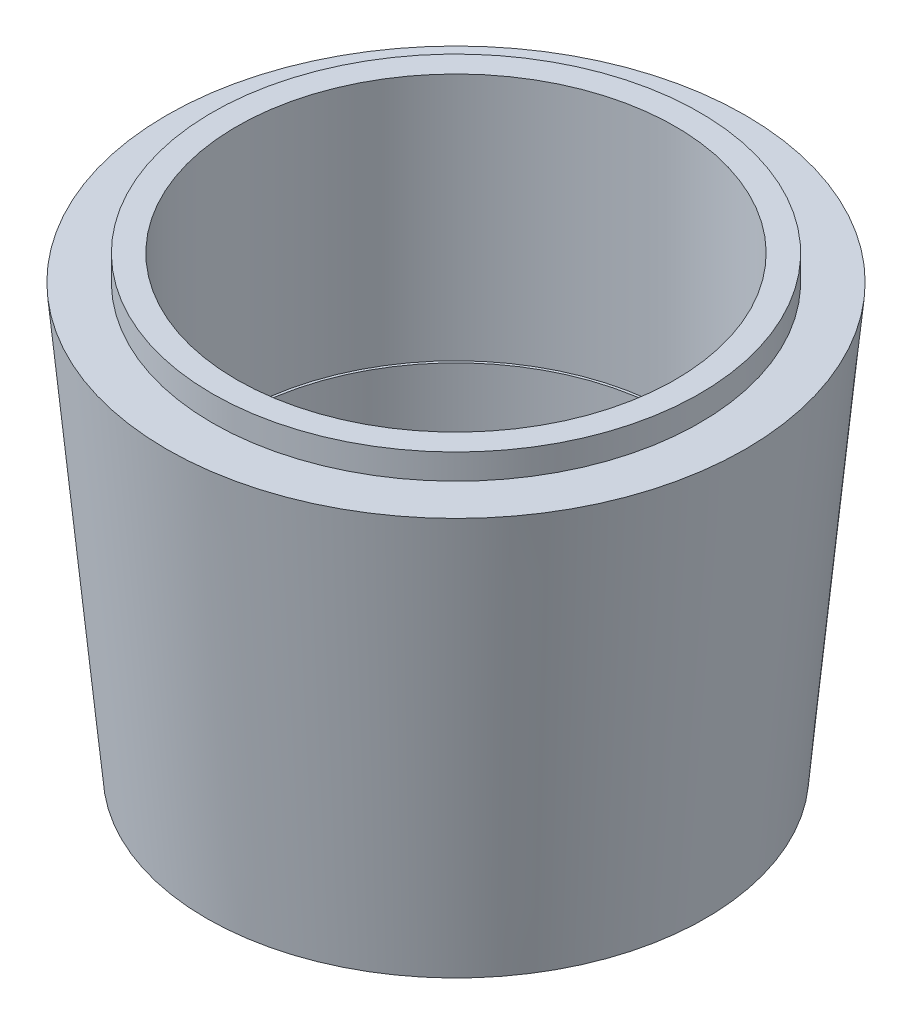
ISO-10303-21;
HEADER;
FILE_DESCRIPTION(('STEP AP214'),'2;1');
FILE_NAME('part.step','',(''),(''),'','','');
FILE_SCHEMA(('AUTOMOTIVE_DESIGN { 1 0 10303 214 1 1 1 1 }'));
ENDSEC;
DATA;
#1=APPLICATION_CONTEXT('core data for automotive mechanical design processes');
#2=APPLICATION_PROTOCOL_DEFINITION('international standard','automotive_design',2000,#1);
#3=PRODUCT_CONTEXT('',#1,'mechanical');
#4=PRODUCT('Part','Part','',(#3));
#5=PRODUCT_RELATED_PRODUCT_CATEGORY('part','',(#4));
#6=PRODUCT_DEFINITION_FORMATION('','',#4);
#7=PRODUCT_DEFINITION_CONTEXT('part definition',#1,'design');
#8=PRODUCT_DEFINITION('design','',#6,#7);
#9=PRODUCT_DEFINITION_SHAPE('','',#8);
#10=(LENGTH_UNIT() NAMED_UNIT(*) SI_UNIT(.MILLI.,.METRE.));
#11=(NAMED_UNIT(*) PLANE_ANGLE_UNIT() SI_UNIT($,.RADIAN.));
#12=(NAMED_UNIT(*) SI_UNIT($,.STERADIAN.) SOLID_ANGLE_UNIT());
#13=UNCERTAINTY_MEASURE_WITH_UNIT(LENGTH_MEASURE(1.E-05),#10,'distance_accuracy_value','');
#14=(GEOMETRIC_REPRESENTATION_CONTEXT(3) GLOBAL_UNCERTAINTY_ASSIGNED_CONTEXT((#13)) GLOBAL_UNIT_ASSIGNED_CONTEXT((#10,
#11,#12)) REPRESENTATION_CONTEXT('',''));
#15=CARTESIAN_POINT('',(0.,0.,0.));
#16=DIRECTION('',(0.,0.,1.));
#17=DIRECTION('',(1.,0.,0.));
#18=AXIS2_PLACEMENT_3D('',#15,#16,#17);
#19=CARTESIAN_POINT('',(20.066,-32.512,0.));
#20=DIRECTION('',(0.,-1.,0.));
#21=DIRECTION('',(0.,0.,-1.));
#22=AXIS2_PLACEMENT_3D('',#19,#20,#21);
#23=PLANE('',#22);
#24=CARTESIAN_POINT('',(0.,-32.512,0.));
#25=DIRECTION('',(0.,1.,0.));
#26=DIRECTION('',(0.,0.,1.));
#27=AXIS2_PLACEMENT_3D('',#24,#25,#26);
#28=CIRCLE('',#27,20.066);
#29=CARTESIAN_POINT('',(0.,-32.512,20.066));
#30=VERTEX_POINT('',#29);
#31=EDGE_CURVE('E10',#30,#30,#28,.T.);
#32=ORIENTED_EDGE('',*,*,#31,.F.);
#33=EDGE_LOOP('',(#32));
#34=FACE_BOUND('',#33,.T.);
#35=CARTESIAN_POINT('',(0.,-32.512,0.));
#36=DIRECTION('',(0.,1.,0.));
#37=DIRECTION('',(0.,0.,1.));
#38=AXIS2_PLACEMENT_3D('',#35,#36,#37);
#39=CIRCLE('',#38,21.7932);
#40=CARTESIAN_POINT('',(0.,-32.512,21.7932));
#41=VERTEX_POINT('',#40);
#42=EDGE_CURVE('E69',#41,#41,#39,.T.);
#43=ORIENTED_EDGE('',*,*,#42,.T.);
#44=EDGE_LOOP('',(#43));
#45=FACE_BOUND('',#44,.T.);
#46=ADVANCED_FACE('F35',(#34,#45),#23,.F.);
#47=CARTESIAN_POINT('',(0.,-32.512,0.));
#48=DIRECTION('',(0.,-1.,0.));
#49=DIRECTION('',(0.,0.,-1.));
#50=AXIS2_PLACEMENT_3D('',#47,#48,#49);
#51=CONICAL_SURFACE('',#50,20.066,0.235619449019235);
#52=CARTESIAN_POINT('',(0.,-42.8360146489052,0.));
#53=DIRECTION('',(0.,1.,0.));
#54=DIRECTION('',(0.,0.,1.));
#55=AXIS2_PLACEMENT_3D('',#52,#53,#54);
#56=CIRCLE('',#55,22.5445766256341);
#57=CARTESIAN_POINT('',(0.,-42.8360146489052,22.5445766256341));
#58=VERTEX_POINT('',#57);
#59=EDGE_CURVE('E41',#58,#58,#56,.T.);
#60=ORIENTED_EDGE('',*,*,#59,.F.);
#61=EDGE_LOOP('',(#60));
#62=FACE_BOUND('',#61,.T.);
#63=ORIENTED_EDGE('',*,*,#31,.T.);
#64=EDGE_LOOP('',(#63));
#65=FACE_BOUND('',#64,.T.);
#66=ADVANCED_FACE('F118',(#62,#65),#51,.F.);
#67=CARTESIAN_POINT('',(25.0845766256341,-42.8360146489052,0.));
#68=DIRECTION('',(0.,1.,0.));
#69=DIRECTION('',(0.,0.,1.));
#70=AXIS2_PLACEMENT_3D('',#67,#68,#69);
#71=PLANE('',#70);
#72=CARTESIAN_POINT('',(0.,-42.8360146489052,0.));
#73=DIRECTION('',(0.,1.,0.));
#74=DIRECTION('',(0.,0.,1.));
#75=AXIS2_PLACEMENT_3D('',#72,#73,#74);
#76=CIRCLE('',#75,25.0845766256341);
#77=CARTESIAN_POINT('',(0.,-42.8360146489052,25.0845766256341));
#78=VERTEX_POINT('',#77);
#79=EDGE_CURVE('E45',#78,#78,#76,.T.);
#80=ORIENTED_EDGE('',*,*,#79,.F.);
#81=EDGE_LOOP('',(#80));
#82=FACE_BOUND('',#81,.T.);
#83=ORIENTED_EDGE('',*,*,#59,.T.);
#84=EDGE_LOOP('',(#83));
#85=FACE_BOUND('',#84,.T.);
#86=ADVANCED_FACE('F113',(#82,#85),#71,.F.);
#87=CARTESIAN_POINT('',(0.,-42.8360146489052,0.));
#88=DIRECTION('',(0.,1.,0.));
#89=DIRECTION('',(0.,0.,1.));
#90=AXIS2_PLACEMENT_3D('',#87,#88,#89);
#91=CONICAL_SURFACE('',#90,25.0845766256341,0.0930728781754716);
#92=CARTESIAN_POINT('',(0.,0.,0.));
#93=DIRECTION('',(0.,1.,0.));
#94=DIRECTION('',(0.,0.,1.));
#95=AXIS2_PLACEMENT_3D('',#92,#93,#94);
#96=CIRCLE('',#95,29.083);
#97=CARTESIAN_POINT('',(0.,0.,29.083));
#98=VERTEX_POINT('',#97);
#99=EDGE_CURVE('E49',#98,#98,#96,.T.);
#100=ORIENTED_EDGE('',*,*,#99,.F.);
#101=EDGE_LOOP('',(#100));
#102=FACE_BOUND('',#101,.T.);
#103=ORIENTED_EDGE('',*,*,#79,.T.);
#104=EDGE_LOOP('',(#103));
#105=FACE_BOUND('',#104,.T.);
#106=ADVANCED_FACE('F107',(#102,#105),#91,.T.);
#107=CARTESIAN_POINT('',(24.4983,0.,0.));
#108=DIRECTION('',(0.,-1.,0.));
#109=DIRECTION('',(0.,0.,-1.));
#110=AXIS2_PLACEMENT_3D('',#107,#108,#109);
#111=PLANE('',#110);
#112=CARTESIAN_POINT('',(0.,0.,0.));
#113=DIRECTION('',(0.,1.,0.));
#114=DIRECTION('',(0.,0.,1.));
#115=AXIS2_PLACEMENT_3D('',#112,#113,#114);
#116=CIRCLE('',#115,24.4983);
#117=CARTESIAN_POINT('',(0.,0.,24.4983));
#118=VERTEX_POINT('',#117);
#119=EDGE_CURVE('E54',#118,#118,#116,.T.);
#120=ORIENTED_EDGE('',*,*,#119,.F.);
#121=EDGE_LOOP('',(#120));
#122=FACE_BOUND('',#121,.T.);
#123=ORIENTED_EDGE('',*,*,#99,.T.);
#124=EDGE_LOOP('',(#123));
#125=FACE_BOUND('',#124,.T.);
#126=ADVANCED_FACE('F101',(#122,#125),#111,.F.);
#127=CARTESIAN_POINT('',(0.,5.64153233054377,0.));
#128=DIRECTION('',(0.,1.,0.));
#129=DIRECTION('',(0.,0.,1.));
#130=AXIS2_PLACEMENT_3D('',#127,#128,#129);
#131=CYLINDRICAL_SURFACE('',#130,24.4983);
#132=CARTESIAN_POINT('',(0.,2.54,0.));
#133=DIRECTION('',(0.,1.,0.));
#134=DIRECTION('',(0.,0.,1.));
#135=AXIS2_PLACEMENT_3D('',#132,#133,#134);
#136=CIRCLE('',#135,24.4983);
#137=CARTESIAN_POINT('',(0.,2.54,24.4983));
#138=VERTEX_POINT('',#137);
#139=EDGE_CURVE('E57',#138,#138,#136,.T.);
#140=ORIENTED_EDGE('',*,*,#139,.F.);
#141=EDGE_LOOP('',(#140));
#142=FACE_BOUND('',#141,.T.);
#143=ORIENTED_EDGE('',*,*,#119,.T.);
#144=EDGE_LOOP('',(#143));
#145=FACE_BOUND('',#144,.T.);
#146=ADVANCED_FACE('F95',(#142,#145),#131,.T.);
#147=CARTESIAN_POINT('',(22.0472,2.54,0.));
#148=DIRECTION('',(0.,-1.,0.));
#149=DIRECTION('',(0.,0.,-1.));
#150=AXIS2_PLACEMENT_3D('',#147,#148,#149);
#151=PLANE('',#150);
#152=CARTESIAN_POINT('',(0.,2.54,0.));
#153=DIRECTION('',(0.,1.,0.));
#154=DIRECTION('',(0.,0.,1.));
#155=AXIS2_PLACEMENT_3D('',#152,#153,#154);
#156=CIRCLE('',#155,22.0472);
#157=CARTESIAN_POINT('',(0.,2.54,22.0472));
#158=VERTEX_POINT('',#157);
#159=EDGE_CURVE('E60',#158,#158,#156,.T.);
#160=ORIENTED_EDGE('',*,*,#159,.F.);
#161=EDGE_LOOP('',(#160));
#162=FACE_BOUND('',#161,.T.);
#163=ORIENTED_EDGE('',*,*,#139,.T.);
#164=EDGE_LOOP('',(#163));
#165=FACE_BOUND('',#164,.T.);
#166=ADVANCED_FACE('F89',(#162,#165),#151,.F.);
#167=CARTESIAN_POINT('',(0.,5.64153233054377,0.));
#168=DIRECTION('',(0.,1.,0.));
#169=DIRECTION('',(0.,0.,1.));
#170=AXIS2_PLACEMENT_3D('',#167,#168,#169);
#171=CYLINDRICAL_SURFACE('',#170,22.0472);
#172=CARTESIAN_POINT('',(0.,-22.4282,0.));
#173=DIRECTION('',(0.,1.,0.));
#174=DIRECTION('',(0.,0.,1.));
#175=AXIS2_PLACEMENT_3D('',#172,#173,#174);
#176=CIRCLE('',#175,22.0472);
#177=CARTESIAN_POINT('',(0.,-22.4282,22.0472));
#178=VERTEX_POINT('',#177);
#179=EDGE_CURVE('E63',#178,#178,#176,.T.);
#180=ORIENTED_EDGE('',*,*,#179,.F.);
#181=EDGE_LOOP('',(#180));
#182=FACE_BOUND('',#181,.T.);
#183=ORIENTED_EDGE('',*,*,#159,.T.);
#184=EDGE_LOOP('',(#183));
#185=FACE_BOUND('',#184,.T.);
#186=ADVANCED_FACE('F83',(#182,#185),#171,.F.);
#187=CARTESIAN_POINT('',(21.7932,-22.4282,0.));
#188=DIRECTION('',(0.,-1.,0.));
#189=DIRECTION('',(0.,0.,-1.));
#190=AXIS2_PLACEMENT_3D('',#187,#188,#189);
#191=PLANE('',#190);
#192=CARTESIAN_POINT('',(0.,-22.4282,0.));
#193=DIRECTION('',(0.,1.,0.));
#194=DIRECTION('',(0.,0.,1.));
#195=AXIS2_PLACEMENT_3D('',#192,#193,#194);
#196=CIRCLE('',#195,21.7932);
#197=CARTESIAN_POINT('',(0.,-22.4282,21.7932));
#198=VERTEX_POINT('',#197);
#199=EDGE_CURVE('E66',#198,#198,#196,.T.);
#200=ORIENTED_EDGE('',*,*,#199,.F.);
#201=EDGE_LOOP('',(#200));
#202=FACE_BOUND('',#201,.T.);
#203=ORIENTED_EDGE('',*,*,#179,.T.);
#204=EDGE_LOOP('',(#203));
#205=FACE_BOUND('',#204,.T.);
#206=ADVANCED_FACE('F77',(#202,#205),#191,.F.);
#207=CARTESIAN_POINT('',(0.,5.64153233054377,0.));
#208=DIRECTION('',(0.,1.,0.));
#209=DIRECTION('',(0.,0.,1.));
#210=AXIS2_PLACEMENT_3D('',#207,#208,#209);
#211=CYLINDRICAL_SURFACE('',#210,21.7932);
#212=ORIENTED_EDGE('',*,*,#42,.F.);
#213=EDGE_LOOP('',(#212));
#214=FACE_BOUND('',#213,.T.);
#215=ORIENTED_EDGE('',*,*,#199,.T.);
#216=EDGE_LOOP('',(#215));
#217=FACE_BOUND('',#216,.T.);
#218=ADVANCED_FACE('F74',(#214,#217),#211,.F.);
#219=CLOSED_SHELL('',(#46,#66,#86,#106,#126,#146,#166,#186,#206,#218));
#220=MANIFOLD_SOLID_BREP('B2',#219);
#221=ADVANCED_BREP_SHAPE_REPRESENTATION('',(#18,#220),#14);
#222=SHAPE_DEFINITION_REPRESENTATION(#9,#221);
ENDSEC;
END-ISO-10303-21;
